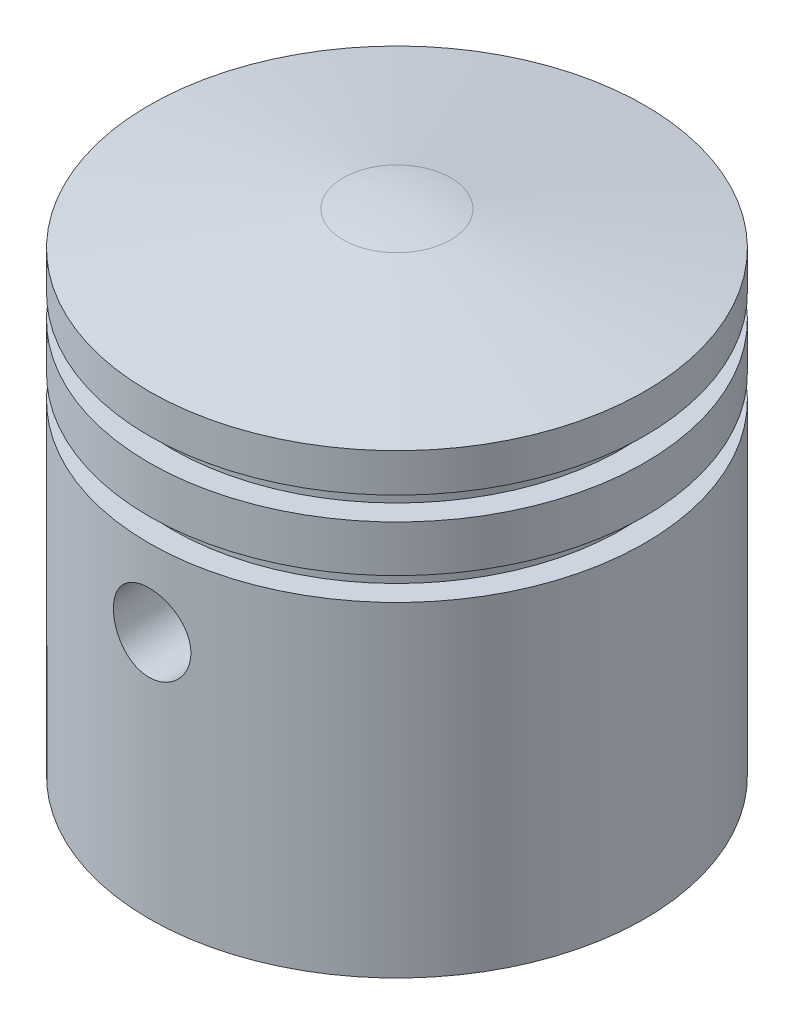
ISO-10303-21;
HEADER;
FILE_DESCRIPTION(('STEP AP214'),'2;1');
FILE_NAME('part.step','',(''),(''),'','','');
FILE_SCHEMA(('AUTOMOTIVE_DESIGN { 1 0 10303 214 1 1 1 1 }'));
ENDSEC;
DATA;
#1=APPLICATION_CONTEXT('core data for automotive mechanical design processes');
#2=APPLICATION_PROTOCOL_DEFINITION('international standard','automotive_design',2000,#1);
#3=PRODUCT_CONTEXT('',#1,'mechanical');
#4=PRODUCT('Part','Part','',(#3));
#5=PRODUCT_RELATED_PRODUCT_CATEGORY('part','',(#4));
#6=PRODUCT_DEFINITION_FORMATION('','',#4);
#7=PRODUCT_DEFINITION_CONTEXT('part definition',#1,'design');
#8=PRODUCT_DEFINITION('design','',#6,#7);
#9=PRODUCT_DEFINITION_SHAPE('','',#8);
#10=(LENGTH_UNIT() NAMED_UNIT(*) SI_UNIT(.MILLI.,.METRE.));
#11=(NAMED_UNIT(*) PLANE_ANGLE_UNIT() SI_UNIT($,.RADIAN.));
#12=(NAMED_UNIT(*) SI_UNIT($,.STERADIAN.) SOLID_ANGLE_UNIT());
#13=UNCERTAINTY_MEASURE_WITH_UNIT(LENGTH_MEASURE(1.E-05),#10,'distance_accuracy_value','');
#14=(GEOMETRIC_REPRESENTATION_CONTEXT(3) GLOBAL_UNCERTAINTY_ASSIGNED_CONTEXT((#13)) GLOBAL_UNIT_ASSIGNED_CONTEXT((#10,
#11,#12)) REPRESENTATION_CONTEXT('',''));
#15=CARTESIAN_POINT('',(0.,0.,0.));
#16=DIRECTION('',(0.,0.,1.));
#17=DIRECTION('',(1.,0.,0.));
#18=AXIS2_PLACEMENT_3D('',#15,#16,#17);
#19=CARTESIAN_POINT('',(0.,8.,0.));
#20=DIRECTION('',(0.,-1.,0.));
#21=DIRECTION('',(0.,0.,-1.));
#22=AXIS2_PLACEMENT_3D('',#19,#20,#21);
#23=CYLINDRICAL_SURFACE('',#22,10.);
#24=CARTESIAN_POINT('',(2.5,0.,-9.68245836551854));
#25=CARTESIAN_POINT('',(2.49999607859307,0.138050750926577,-9.6824610008786));
#26=CARTESIAN_POINT('',(2.48852624549765,0.276144898678522,-9.68544306014597));
#27=CARTESIAN_POINT('',(2.44302312546379,0.54836757817351,-9.69701861992564));
#28=CARTESIAN_POINT('',(2.4089767067421,0.682493754468185,-9.7056153862163));
#29=CARTESIAN_POINT('',(2.31949119963204,0.942803538187182,-9.7273872459615));
#30=CARTESIAN_POINT('',(2.26407972785449,1.06899715538571,-9.74055642690458));
#31=CARTESIAN_POINT('',(2.13352114126138,1.31031085253988,-9.76998192028759));
#32=CARTESIAN_POINT('',(2.05837318856068,1.42543046208022,-9.78623836378489));
#33=CARTESIAN_POINT('',(1.88870842731188,1.64386164526222,-9.82040716355625));
#34=CARTESIAN_POINT('',(1.79383688770405,1.74689360035005,-9.83834597623034));
#35=CARTESIAN_POINT('',(1.58818206410066,1.93576139436034,-9.87362875515294));
#36=CARTESIAN_POINT('',(1.47739729418031,2.02159562562175,-9.89097266566388));
#37=CARTESIAN_POINT('',(1.24114520107895,2.17477546763128,-9.92340415520582));
#38=CARTESIAN_POINT('',(1.11549457619512,2.24184638816147,-9.93845687400592));
#39=CARTESIAN_POINT('',(0.854263184292762,2.35380964415308,-9.96430811925984));
#40=CARTESIAN_POINT('',(0.71868388579194,2.39870525191551,-9.97510727334345));
#41=CARTESIAN_POINT('',(0.444358758754161,2.46414783457858,-9.9910475884818));
#42=CARTESIAN_POINT('',(0.305732719548975,2.48516964432658,-9.99629893844314));
#43=CARTESIAN_POINT('',(0.0268288192627692,2.50375837927555,-10.000935941073));
#44=CARTESIAN_POINT('',(-0.113448794538068,2.5013287722096,-10.000322460967));
#45=CARTESIAN_POINT('',(-0.388380617930968,2.47342514974986,-9.99338094953534));
#46=CARTESIAN_POINT('',(-0.523090539002667,2.44846367494614,-9.98718002340871));
#47=CARTESIAN_POINT('',(-0.786345618534215,2.3770287299515,-9.96990836524857));
#48=CARTESIAN_POINT('',(-0.914890448426095,2.33055411462259,-9.95883737398452));
#49=CARTESIAN_POINT('',(-1.16351675875452,2.21699742931294,-9.93287509700884));
#50=CARTESIAN_POINT('',(-1.28351127441626,2.14973295533825,-9.91795019695011));
#51=CARTESIAN_POINT('',(-1.51068905585122,1.99664432088374,-9.88589903809692));
#52=CARTESIAN_POINT('',(-1.61787008771376,1.91081693143937,-9.8687723965265));
#53=CARTESIAN_POINT('',(-1.81943508771239,1.72029125801763,-9.83363713769356));
#54=CARTESIAN_POINT('',(-1.91339419768799,1.61514510765226,-9.81561719525297));
#55=CARTESIAN_POINT('',(-2.08244093990755,1.39040002645972,-9.78115043517327));
#56=CARTESIAN_POINT('',(-2.15752769011507,1.2708004205089,-9.76470369108289));
#57=CARTESIAN_POINT('',(-2.28697032255647,1.01970996585114,-9.73520496829319));
#58=CARTESIAN_POINT('',(-2.34122391742612,0.888164269687197,-9.72216983717007));
#59=CARTESIAN_POINT('',(-2.42671405159095,0.617414531923158,-9.70118640148669));
#60=CARTESIAN_POINT('',(-2.45795551638266,0.478212136015404,-9.69323700842733));
#61=CARTESIAN_POINT('',(-2.49582963866592,0.200040498470083,-9.68355356007457));
#62=CARTESIAN_POINT('',(-2.50309047391912,0.0611622066589767,-9.68166088976933));
#63=CARTESIAN_POINT('',(-2.49451699051516,-0.215821936585254,-9.68387343364692));
#64=CARTESIAN_POINT('',(-2.4786847978498,-0.353927857949441,-9.687978095703));
#65=CARTESIAN_POINT('',(-2.42492546393825,-0.623114264948572,-9.7015708198498));
#66=CARTESIAN_POINT('',(-2.3873640682819,-0.754272726569197,-9.71096970242532));
#67=CARTESIAN_POINT('',(-2.29161808167046,-1.00843145785333,-9.73400718262805));
#68=CARTESIAN_POINT('',(-2.2334310477125,-1.13143075905578,-9.74764628246408));
#69=CARTESIAN_POINT('',(-2.0967706679366,-1.3684412778669,-9.77796137095511));
#70=CARTESIAN_POINT('',(-2.01792175383564,-1.48222884004298,-9.79469168607245));
#71=CARTESIAN_POINT('',(-1.84265073233613,-1.69518836280148,-9.82917083071113));
#72=CARTESIAN_POINT('',(-1.7462257370136,-1.79435791665011,-9.84691982728307));
#73=CARTESIAN_POINT('',(-1.53565680246182,-1.97781104257092,-9.88197403031774));
#74=CARTESIAN_POINT('',(-1.42112988132898,-2.0616600625488,-9.8992570206188));
#75=CARTESIAN_POINT('',(-1.17925670673669,-2.20893586695125,-9.93097216613689));
#76=CARTESIAN_POINT('',(-1.05191112239398,-2.27236371660821,-9.94540447003949));
#77=CARTESIAN_POINT('',(-0.788895504327728,-2.37644603452793,-9.96970115738325));
#78=CARTESIAN_POINT('',(-0.653293452569707,-2.41726428437906,-9.97959830022409));
#79=CARTESIAN_POINT('',(-0.376874400797019,-2.47546033460841,-9.99385293395789));
#80=CARTESIAN_POINT('',(-0.236058412603102,-2.49284265873904,-9.99821149393422));
#81=CARTESIAN_POINT('',(0.0427088161083075,-2.50341897393885,-10.0008542352202));
#82=CARTESIAN_POINT('',(0.180634567415054,-2.49725427273852,-9.99929947199971));
#83=CARTESIAN_POINT('',(0.453418741036876,-2.46238043176413,-9.99064741143608));
#84=CARTESIAN_POINT('',(0.588277254452321,-2.43367196246708,-9.98355027892922));
#85=CARTESIAN_POINT('',(0.850427589111935,-2.35486945057285,-9.96463582134723));
#86=CARTESIAN_POINT('',(0.977756236452157,-2.30489136671405,-9.95284411255981));
#87=CARTESIAN_POINT('',(1.22229263260406,-2.18507355245107,-9.92578222284145));
#88=CARTESIAN_POINT('',(1.33949910316408,-2.11523131832379,-9.91051160346894));
#89=CARTESIAN_POINT('',(1.56350482105826,-1.95571191500967,-9.87768124200718));
#90=CARTESIAN_POINT('',(1.66998747074584,-1.86559964274043,-9.86007542354161));
#91=CARTESIAN_POINT('',(1.86653755068376,-1.66894287005663,-9.82476622642974));
#92=CARTESIAN_POINT('',(1.95660081269148,-1.56239420972209,-9.80706282418256));
#93=CARTESIAN_POINT('',(2.11940506617958,-1.33349646452635,-9.77318689613756));
#94=CARTESIAN_POINT('',(2.19179154854095,-1.21088969158687,-9.75704909183222));
#95=CARTESIAN_POINT('',(2.31481724146367,-0.954861275312952,-9.7285988873707));
#96=CARTESIAN_POINT('',(2.36547227438038,-0.821447584765384,-9.71628370583034));
#97=CARTESIAN_POINT('',(2.43605632142751,-0.573557470412099,-9.69879771876843));
#98=CARTESIAN_POINT('',(2.4599829264922,-0.460267089034658,-9.69271657508747));
#99=CARTESIAN_POINT('',(2.49195573142942,-0.23132782750578,-9.6845459645655));
#100=CARTESIAN_POINT('',(2.50000328592938,-0.115679149388994,-9.6824561572277));
#101=CARTESIAN_POINT('',(2.5,0.,-9.68245836551854));
#102=B_SPLINE_CURVE_WITH_KNOTS('',3,(#24,#25,#26,#27,#28,#29,#30,#31,#32,#33,#34,#35,#36,#37,
#38,#39,#40,#41,#42,#43,#44,#45,#46,#47,#48,#49,#50,#51,#52,#53,#54,#55,#56,#57,#58,#59,#60,#61,
#62,#63,#64,#65,#66,#67,#68,#69,#70,#71,#72,#73,#74,#75,#76,#77,#78,#79,#80,#81,#82,#83,#84,#85,
#86,#87,#88,#89,#90,#91,#92,#93,#94,#95,#96,#97,#98,#99,#100,#101),.UNSPECIFIED.,.T.,.F.,(4,2,2,
2,2,2,2,2,2,2,2,2,2,2,2,2,2,2,2,2,2,2,2,2,2,2,2,2,2,2,2,2,2,2,2,2,2,2,4),(0.,0.413727441736136,
0.827695741428666,1.24113072716602,1.65458326755479,2.07623954192976,2.49793521479867,
2.9255149639792,3.35303159847092,3.77188750995347,4.1906814866602,4.60018262688947,
5.00970556724786,5.42292874254444,5.83622385468913,6.26070466571911,6.68520531199802,
7.11176432008402,7.53823200129547,7.95343574764204,8.36860127188747,8.77697405014151,
9.18539521426363,9.60182845864102,10.0183301888999,10.4452533097026,10.872154157245,
11.2959207281187,11.7196054891398,12.131834461324,12.5440511738193,12.9540487656466,
13.3640980574302,13.7839709658702,14.2039503157045,14.6317647729113,15.0592672137501,
15.4059782718573,15.7526597510792),.UNSPECIFIED.);
#103=CARTESIAN_POINT('',(2.5,0.,-9.68245836551854));
#104=VERTEX_POINT('',#103);
#105=EDGE_CURVE('E85',#104,#104,#102,.T.);
#106=ORIENTED_EDGE('',*,*,#105,.F.);
#107=EDGE_LOOP('',(#106));
#108=FACE_BOUND('',#107,.T.);
#109=CARTESIAN_POINT('',(0.,8.,0.));
#110=DIRECTION('',(0.,-1.,0.));
#111=DIRECTION('',(0.,0.,-1.));
#112=AXIS2_PLACEMENT_3D('',#109,#110,#111);
#113=CIRCLE('',#112,10.);
#114=CARTESIAN_POINT('',(0.,8.,-10.));
#115=VERTEX_POINT('',#114);
#116=EDGE_CURVE('E100',#115,#115,#113,.T.);
#117=ORIENTED_EDGE('',*,*,#116,.F.);
#118=EDGE_LOOP('',(#117));
#119=FACE_BOUND('',#118,.T.);
#120=CARTESIAN_POINT('',(2.5,0.,9.68245836551854));
#121=CARTESIAN_POINT('',(2.49999607859307,-0.138050750926577,9.6824610008786));
#122=CARTESIAN_POINT('',(2.48852624549765,-0.276144898678522,9.68544306014597));
#123=CARTESIAN_POINT('',(2.44302312546379,-0.54836757817351,9.69701861992564));
#124=CARTESIAN_POINT('',(2.4089767067421,-0.682493754468185,9.7056153862163));
#125=CARTESIAN_POINT('',(2.31949119963204,-0.942803538187182,9.7273872459615));
#126=CARTESIAN_POINT('',(2.26407972785449,-1.06899715538571,9.74055642690458));
#127=CARTESIAN_POINT('',(2.13352114126138,-1.31031085253988,9.76998192028759));
#128=CARTESIAN_POINT('',(2.05837318856068,-1.42543046208022,9.78623836378489));
#129=CARTESIAN_POINT('',(1.88870842731188,-1.64386164526222,9.82040716355625));
#130=CARTESIAN_POINT('',(1.79383688770405,-1.74689360035005,9.83834597623034));
#131=CARTESIAN_POINT('',(1.58818206410066,-1.93576139436034,9.87362875515294));
#132=CARTESIAN_POINT('',(1.47739729418031,-2.02159562562175,9.89097266566388));
#133=CARTESIAN_POINT('',(1.24114520107895,-2.17477546763128,9.92340415520582));
#134=CARTESIAN_POINT('',(1.11549457619512,-2.24184638816147,9.93845687400592));
#135=CARTESIAN_POINT('',(0.854263184292762,-2.35380964415308,9.96430811925984));
#136=CARTESIAN_POINT('',(0.71868388579194,-2.39870525191551,9.97510727334345));
#137=CARTESIAN_POINT('',(0.444358758754161,-2.46414783457858,9.9910475884818));
#138=CARTESIAN_POINT('',(0.305732719548975,-2.48516964432658,9.99629893844314));
#139=CARTESIAN_POINT('',(0.0268288192627692,-2.50375837927555,10.000935941073));
#140=CARTESIAN_POINT('',(-0.113448794538068,-2.5013287722096,10.000322460967));
#141=CARTESIAN_POINT('',(-0.388380617930968,-2.47342514974986,9.99338094953534));
#142=CARTESIAN_POINT('',(-0.523090539002667,-2.44846367494614,9.98718002340871));
#143=CARTESIAN_POINT('',(-0.786345618534215,-2.3770287299515,9.96990836524857));
#144=CARTESIAN_POINT('',(-0.914890448426095,-2.33055411462259,9.95883737398452));
#145=CARTESIAN_POINT('',(-1.16351675875452,-2.21699742931294,9.93287509700884));
#146=CARTESIAN_POINT('',(-1.28351127441626,-2.14973295533825,9.91795019695011));
#147=CARTESIAN_POINT('',(-1.51068905585122,-1.99664432088374,9.88589903809692));
#148=CARTESIAN_POINT('',(-1.61787008771376,-1.91081693143937,9.8687723965265));
#149=CARTESIAN_POINT('',(-1.81943508771239,-1.72029125801763,9.83363713769356));
#150=CARTESIAN_POINT('',(-1.91339419768799,-1.61514510765226,9.81561719525297));
#151=CARTESIAN_POINT('',(-2.08244093990755,-1.39040002645972,9.78115043517327));
#152=CARTESIAN_POINT('',(-2.15752769011507,-1.2708004205089,9.76470369108289));
#153=CARTESIAN_POINT('',(-2.28697032255647,-1.01970996585114,9.73520496829319));
#154=CARTESIAN_POINT('',(-2.34122391742612,-0.888164269687197,9.72216983717007));
#155=CARTESIAN_POINT('',(-2.42671405159095,-0.617414531923158,9.70118640148669));
#156=CARTESIAN_POINT('',(-2.45795551638266,-0.478212136015404,9.69323700842733));
#157=CARTESIAN_POINT('',(-2.49582963866592,-0.200040498470083,9.68355356007457));
#158=CARTESIAN_POINT('',(-2.50309047391912,-0.0611622066589767,9.68166088976933));
#159=CARTESIAN_POINT('',(-2.49451699051516,0.215821936585254,9.68387343364692));
#160=CARTESIAN_POINT('',(-2.4786847978498,0.353927857949441,9.687978095703));
#161=CARTESIAN_POINT('',(-2.42492546393825,0.623114264948572,9.7015708198498));
#162=CARTESIAN_POINT('',(-2.3873640682819,0.754272726569197,9.71096970242532));
#163=CARTESIAN_POINT('',(-2.29161808167046,1.00843145785333,9.73400718262805));
#164=CARTESIAN_POINT('',(-2.2334310477125,1.13143075905578,9.74764628246408));
#165=CARTESIAN_POINT('',(-2.0967706679366,1.3684412778669,9.77796137095511));
#166=CARTESIAN_POINT('',(-2.01792175383564,1.48222884004298,9.79469168607245));
#167=CARTESIAN_POINT('',(-1.84265073233613,1.69518836280148,9.82917083071113));
#168=CARTESIAN_POINT('',(-1.7462257370136,1.79435791665011,9.84691982728307));
#169=CARTESIAN_POINT('',(-1.53565680246182,1.97781104257092,9.88197403031774));
#170=CARTESIAN_POINT('',(-1.42112988132898,2.0616600625488,9.8992570206188));
#171=CARTESIAN_POINT('',(-1.17925670673669,2.20893586695125,9.93097216613689));
#172=CARTESIAN_POINT('',(-1.05191112239398,2.27236371660821,9.94540447003949));
#173=CARTESIAN_POINT('',(-0.788895504327728,2.37644603452793,9.96970115738325));
#174=CARTESIAN_POINT('',(-0.653293452569707,2.41726428437906,9.97959830022409));
#175=CARTESIAN_POINT('',(-0.376874400797019,2.47546033460841,9.99385293395789));
#176=CARTESIAN_POINT('',(-0.236058412603102,2.49284265873904,9.99821149393422));
#177=CARTESIAN_POINT('',(0.0427088161083075,2.50341897393885,10.0008542352202));
#178=CARTESIAN_POINT('',(0.180634567415054,2.49725427273852,9.99929947199971));
#179=CARTESIAN_POINT('',(0.453418741036876,2.46238043176413,9.99064741143608));
#180=CARTESIAN_POINT('',(0.588277254452321,2.43367196246708,9.98355027892922));
#181=CARTESIAN_POINT('',(0.850427589111935,2.35486945057285,9.96463582134723));
#182=CARTESIAN_POINT('',(0.977756236452157,2.30489136671405,9.95284411255981));
#183=CARTESIAN_POINT('',(1.22229263260406,2.18507355245107,9.92578222284145));
#184=CARTESIAN_POINT('',(1.33949910316408,2.11523131832379,9.91051160346894));
#185=CARTESIAN_POINT('',(1.56350482105826,1.95571191500967,9.87768124200718));
#186=CARTESIAN_POINT('',(1.66998747074584,1.86559964274043,9.86007542354161));
#187=CARTESIAN_POINT('',(1.86653755068376,1.66894287005663,9.82476622642974));
#188=CARTESIAN_POINT('',(1.95660081269148,1.56239420972209,9.80706282418256));
#189=CARTESIAN_POINT('',(2.11940506617958,1.33349646452635,9.77318689613756));
#190=CARTESIAN_POINT('',(2.19179154854095,1.21088969158687,9.75704909183222));
#191=CARTESIAN_POINT('',(2.31481724146367,0.954861275312952,9.7285988873707));
#192=CARTESIAN_POINT('',(2.36547227438038,0.821447584765384,9.71628370583034));
#193=CARTESIAN_POINT('',(2.43605632142751,0.573557470412099,9.69879771876843));
#194=CARTESIAN_POINT('',(2.4599829264922,0.460267089034658,9.69271657508747));
#195=CARTESIAN_POINT('',(2.49195573142942,0.23132782750578,9.6845459645655));
#196=CARTESIAN_POINT('',(2.50000328592938,0.115679149388994,9.6824561572277));
#197=CARTESIAN_POINT('',(2.5,0.,9.68245836551854));
#198=B_SPLINE_CURVE_WITH_KNOTS('',3,(#120,#121,#122,#123,#124,#125,#126,#127,#128,#129,#130,
#131,#132,#133,#134,#135,#136,#137,#138,#139,#140,#141,#142,#143,#144,#145,#146,#147,#148,#149,
#150,#151,#152,#153,#154,#155,#156,#157,#158,#159,#160,#161,#162,#163,#164,#165,#166,#167,#168,
#169,#170,#171,#172,#173,#174,#175,#176,#177,#178,#179,#180,#181,#182,#183,#184,#185,#186,#187,
#188,#189,#190,#191,#192,#193,#194,#195,#196,#197),.UNSPECIFIED.,.T.,.F.,(4,2,2,2,2,2,2,2,2,2,2,
2,2,2,2,2,2,2,2,2,2,2,2,2,2,2,2,2,2,2,2,2,2,2,2,2,2,2,4),(0.,0.413727441736136,
0.827695741428666,1.24113072716602,1.65458326755479,2.07623954192976,2.49793521479867,
2.9255149639792,3.35303159847092,3.77188750995347,4.1906814866602,4.60018262688947,
5.00970556724786,5.42292874254444,5.83622385468913,6.26070466571911,6.68520531199802,
7.11176432008402,7.53823200129547,7.95343574764204,8.36860127188747,8.77697405014151,
9.18539521426363,9.60182845864102,10.0183301888999,10.4452533097026,10.872154157245,
11.2959207281187,11.7196054891398,12.131834461324,12.5440511738193,12.9540487656466,
13.3640980574302,13.7839709658702,14.2039503157045,14.6317647729113,15.0592672137501,
15.4059782718573,15.7526597510792),.UNSPECIFIED.);
#199=CARTESIAN_POINT('',(2.5,0.,9.68245836551854));
#200=VERTEX_POINT('',#199);
#201=EDGE_CURVE('E63',#200,#200,#198,.T.);
#202=ORIENTED_EDGE('',*,*,#201,.F.);
#203=EDGE_LOOP('',(#202));
#204=FACE_BOUND('',#203,.T.);
#205=CARTESIAN_POINT('',(0.,-6.,0.));
#206=DIRECTION('',(0.,-1.,0.));
#207=DIRECTION('',(0.,0.,-1.));
#208=AXIS2_PLACEMENT_3D('',#205,#206,#207);
#209=CIRCLE('',#208,10.);
#210=CARTESIAN_POINT('',(0.,-6.,-10.));
#211=VERTEX_POINT('',#210);
#212=EDGE_CURVE('E40',#211,#211,#209,.F.);
#213=ORIENTED_EDGE('',*,*,#212,.F.);
#214=EDGE_LOOP('',(#213));
#215=FACE_BOUND('',#214,.T.);
#216=ADVANCED_FACE('F36',(#108,#119,#204,#215),#23,.F.);
#217=CARTESIAN_POINT('',(0.,0.,-16.));
#218=DIRECTION('',(0.,0.,1.));
#219=DIRECTION('',(1.,0.,0.));
#220=AXIS2_PLACEMENT_3D('',#217,#218,#219);
#221=CYLINDRICAL_SURFACE('',#220,2.5);
#222=ORIENTED_EDGE('',*,*,#105,.T.);
#223=EDGE_LOOP('',(#222));
#224=FACE_BOUND('',#223,.T.);
#225=CARTESIAN_POINT('',(0.,2.5,-16.));
#226=CARTESIAN_POINT('',(-0.139515097271033,2.49999430172848,-15.9999977019448));
#227=CARTESIAN_POINT('',(-0.279109404865704,2.48828188622644,-15.9981561248574));
#228=CARTESIAN_POINT('',(-0.554391314978102,2.44175630872324,-15.9909869809759));
#229=CARTESIAN_POINT('',(-0.690075061323317,2.40692110749649,-15.9856560884472));
#230=CARTESIAN_POINT('',(-0.953512538047404,2.31522033719338,-15.9721069716578));
#231=CARTESIAN_POINT('',(-1.0812723522899,2.2583719186384,-15.9638909956317));
#232=CARTESIAN_POINT('',(-1.3254212510446,2.12430145485839,-15.9454779403815));
#233=CARTESIAN_POINT('',(-1.44181181036831,2.04708205696406,-15.9352811186255));
#234=CARTESIAN_POINT('',(-1.66091991165162,1.87376695164604,-15.9139426841436));
#235=CARTESIAN_POINT('',(-1.76352747914264,1.77753300510975,-15.9027945139234));
#236=CARTESIAN_POINT('',(-1.95120768822823,1.56921805173111,-15.8808607613029));
#237=CARTESIAN_POINT('',(-2.03627928654192,1.4571361026998,-15.8700752005075));
#238=CARTESIAN_POINT('',(-2.18690544328884,1.21956172865627,-15.8500242812745));
#239=CARTESIAN_POINT('',(-2.25235273557991,1.09400051763821,-15.840767397861));
#240=CARTESIAN_POINT('',(-2.36118681597065,0.833498589142195,-15.8249120174236));
#241=CARTESIAN_POINT('',(-2.40457491010063,0.69855842748944,-15.8183133630222));
#242=CARTESIAN_POINT('',(-2.46771559322167,0.424289098856214,-15.8085863451104));
#243=CARTESIAN_POINT('',(-2.48765705487496,0.285004414181201,-15.8054302653236));
#244=CARTESIAN_POINT('',(-2.50392369757621,0.00503281110735587,-15.8028617107177));
#245=CARTESIAN_POINT('',(-2.50025034860466,-0.13565401946604,-15.8034490028802));
#246=CARTESIAN_POINT('',(-2.4695458080889,-0.413097031852685,-15.8082755045521));
#247=CARTESIAN_POINT('',(-2.44272562959693,-0.549877223353148,-15.8124817218495));
#248=CARTESIAN_POINT('',(-2.36681937833751,-0.816972006359324,-15.8240205634547));
#249=CARTESIAN_POINT('',(-2.31773262684132,-0.947286400640537,-15.8313532830641));
#250=CARTESIAN_POINT('',(-2.19846916949384,-1.19838871267716,-15.8483550685462));
#251=CARTESIAN_POINT('',(-2.12820372315549,-1.31913379177307,-15.8580339308724));
#252=CARTESIAN_POINT('',(-1.96864058146637,-1.54719953568554,-15.878630461501));
#253=CARTESIAN_POINT('',(-1.87934153253017,-1.65451924488747,-15.8895482178821));
#254=CARTESIAN_POINT('',(-1.68309088822333,-1.85391024663331,-15.911537862489));
#255=CARTESIAN_POINT('',(-1.57595800560539,-1.94580315826946,-15.9226101363559));
#256=CARTESIAN_POINT('',(-1.34769694737936,-2.1103331456399,-15.9435512534783));
#257=CARTESIAN_POINT('',(-1.22656870068132,-2.18297012355683,-15.9534200906202));
#258=CARTESIAN_POINT('',(-0.973595927056491,-2.30693807342239,-15.9708539902704));
#259=CARTESIAN_POINT('',(-0.84174418624046,-2.358254558533,-15.9784174854193));
#260=CARTESIAN_POINT('',(-0.571149534696759,-2.43796596744723,-15.9903756000068));
#261=CARTESIAN_POINT('',(-0.4324071306872,-2.46636257406648,-15.9947704520898));
#262=CARTESIAN_POINT('',(-0.153508336763734,-2.49918927645019,-15.9998651172728));
#263=CARTESIAN_POINT('',(-0.0133814615087012,-2.50386447897618,-16.0006027179286));
#264=CARTESIAN_POINT('',(0.265654546411643,-2.48976729466402,-15.9984028649127));
#265=CARTESIAN_POINT('',(0.404563719925157,-2.47099569741089,-15.9954655349964));
#266=CARTESIAN_POINT('',(0.676473446265705,-2.41074161231982,-15.9862692369322));
#267=CARTESIAN_POINT('',(0.809501262056042,-2.36937924173227,-15.9800278421539));
#268=CARTESIAN_POINT('',(1.06673406785663,-2.26524490560121,-15.9649207568356));
#269=CARTESIAN_POINT('',(1.19093861303941,-2.20247186155733,-15.9560549341007));
#270=CARTESIAN_POINT('',(1.42807220225041,-2.05672800887342,-15.9365897274094));
#271=CARTESIAN_POINT('',(1.54090512378373,-1.97360257990952,-15.9259772866342));
#272=CARTESIAN_POINT('',(1.75110696507806,-1.78972791409221,-15.9042388046444));
#273=CARTESIAN_POINT('',(1.84847490447018,-1.68897756079515,-15.8931127309268));
#274=CARTESIAN_POINT('',(2.02588080776691,-1.47161880278279,-15.8714802753665));
#275=CARTESIAN_POINT('',(2.10575398584126,-1.35487515287767,-15.860980411908));
#276=CARTESIAN_POINT('',(2.2447556772664,-1.10948392633866,-15.8419069280583));
#277=CARTESIAN_POINT('',(2.30388478778105,-0.980836692510523,-15.83333325222));
#278=CARTESIAN_POINT('',(2.39946771944995,-0.715770359285808,-15.8191307135236));
#279=CARTESIAN_POINT('',(2.43600654947912,-0.579382531234375,-15.8134908234896));
#280=CARTESIAN_POINT('',(2.48564122040535,-0.302310856336017,-15.8057657028079));
#281=CARTESIAN_POINT('',(2.49873883084997,-0.161627334580991,-15.8036802038444));
#282=CARTESIAN_POINT('',(2.50107452690756,0.118398715907477,-15.8033105804488));
#283=CARTESIAN_POINT('',(2.49057180548425,0.257739096933504,-15.804985160429));
#284=CARTESIAN_POINT('',(2.44656223255901,0.532645297144287,-15.8118569894183));
#285=CARTESIAN_POINT('',(2.41305543086961,0.668211124501717,-15.8170542307995));
#286=CARTESIAN_POINT('',(2.32408329891851,0.93163782664052,-15.8303708885491));
#287=CARTESIAN_POINT('',(2.26863761738581,1.05950547825841,-15.8384876895341));
#288=CARTESIAN_POINT('',(2.13738768546417,1.30416561367627,-15.856731840474));
#289=CARTESIAN_POINT('',(2.06158262820886,1.42095765828843,-15.8668592701083));
#290=CARTESIAN_POINT('',(1.89083008139079,1.64146554412683,-15.8881156809226));
#291=CARTESIAN_POINT('',(1.79569107094768,1.74503219661384,-15.8992540116029));
#292=CARTESIAN_POINT('',(1.58937594638204,1.93482123638674,-15.9212004364073));
#293=CARTESIAN_POINT('',(1.47819612078432,2.02103959859188,-15.9320084534012));
#294=CARTESIAN_POINT('',(1.24216685884341,2.17415122303156,-15.952151024567));
#295=CARTESIAN_POINT('',(1.11723937214238,2.24092537275962,-15.9614763443027));
#296=CARTESIAN_POINT('',(0.857851882357781,2.35244099619295,-15.9775125983888));
#297=CARTESIAN_POINT('',(0.723401776581759,2.39720497255839,-15.9842262014212));
#298=CARTESIAN_POINT('',(0.490314239911591,2.45343302109059,-15.9927744586488));
#299=CARTESIAN_POINT('',(0.393105575651622,2.470868490629,-15.9954699162612));
#300=CARTESIAN_POINT('',(0.197277797850581,2.49415391337908,-15.9990834869762));
#301=CARTESIAN_POINT('',(0.0986587041691179,2.50000402955734,-16.0000016250796));
#302=CARTESIAN_POINT('',(0.,2.5,-16.));
#303=B_SPLINE_CURVE_WITH_KNOTS('',3,(#225,#226,#227,#228,#229,#230,#231,#232,#233,#234,#235,
#236,#237,#238,#239,#240,#241,#242,#243,#244,#245,#246,#247,#248,#249,#250,#251,#252,#253,#254,
#255,#256,#257,#258,#259,#260,#261,#262,#263,#264,#265,#266,#267,#268,#269,#270,#271,#272,#273,
#274,#275,#276,#277,#278,#279,#280,#281,#282,#283,#284,#285,#286,#287,#288,#289,#290,#291,#292,
#293,#294,#295,#296,#297,#298,#299,#300,#301,#302),.UNSPECIFIED.,.T.,.F.,(4,2,2,2,2,2,2,2,2,2,2,
2,2,2,2,2,2,2,2,2,2,2,2,2,2,2,2,2,2,2,2,2,2,2,2,2,2,2,4),(0.,0.418184740477491,
0.836768642528014,1.25502707944103,1.6732311879203,2.09459568152199,2.51598523645422,
2.93963778605759,3.36326525009238,3.78345631134994,4.20362121670545,4.6199957602258,
5.0363829965105,5.45453977402347,5.87272629892068,6.29545732334367,6.71819049513827,
7.14121043754564,7.56419931829866,7.98280854005914,8.40140366528356,8.81779444756567,
9.23420620742031,9.65388541469671,10.0735912160142,10.4970948024959,10.9205861964898,
11.3424741039513,11.764330162293,12.1815758159869,12.598820566189,13.0156924696662,
13.4325808967135,13.8538201231554,14.275156971423,14.6990230419984,15.1224548565628,
15.4181801635154,15.7139013105871),.UNSPECIFIED.);
#304=CARTESIAN_POINT('',(0.,2.5,-16.));
#305=VERTEX_POINT('',#304);
#306=EDGE_CURVE('E10',#305,#305,#303,.T.);
#307=ORIENTED_EDGE('',*,*,#306,.F.);
#308=EDGE_LOOP('',(#307));
#309=FACE_BOUND('',#308,.T.);
#310=ADVANCED_FACE('F79',(#224,#309),#221,.F.);
#311=CARTESIAN_POINT('',(0.,13.4873005463795,0.));
#312=DIRECTION('',(0.,-1.,0.));
#313=DIRECTION('',(0.,0.,-1.));
#314=AXIS2_PLACEMENT_3D('',#311,#312,#313);
#315=CONICAL_SURFACE('',#314,16.,1.39626340159546);
#316=CARTESIAN_POINT('',(0.,15.6961550602442,0.));
#317=DIRECTION('',(0.,1.,0.));
#318=DIRECTION('',(0.,0.,1.));
#319=AXIS2_PLACEMENT_3D('',#316,#317,#318);
#320=CIRCLE('',#319,3.47296355333861);
#321=CARTESIAN_POINT('',(0.,15.6961550602442,3.47296355333861));
#322=VERTEX_POINT('',#321);
#323=EDGE_CURVE('E91',#322,#322,#320,.T.);
#324=ORIENTED_EDGE('',*,*,#323,.F.);
#325=EDGE_LOOP('',(#324));
#326=FACE_BOUND('',#325,.T.);
#327=CARTESIAN_POINT('',(0.,13.4873005463795,0.));
#328=DIRECTION('',(0.,1.,0.));
#329=DIRECTION('',(0.,0.,1.));
#330=AXIS2_PLACEMENT_3D('',#327,#328,#329);
#331=CIRCLE('',#330,16.);
#332=CARTESIAN_POINT('',(0.,13.4873005463795,16.));
#333=VERTEX_POINT('',#332);
#334=EDGE_CURVE('E51',#333,#333,#331,.T.);
#335=ORIENTED_EDGE('',*,*,#334,.T.);
#336=EDGE_LOOP('',(#335));
#337=FACE_BOUND('',#336,.T.);
#338=ADVANCED_FACE('F38',(#326,#337),#315,.T.);
#339=CARTESIAN_POINT('',(0.,16.,0.));
#340=DIRECTION('',(0.,1.,0.));
#341=DIRECTION('',(0.,0.,1.));
#342=AXIS2_PLACEMENT_3D('',#339,#340,#341);
#343=CYLINDRICAL_SURFACE('',#342,16.);
#344=ORIENTED_EDGE('',*,*,#334,.F.);
#345=EDGE_LOOP('',(#344));
#346=FACE_BOUND('',#345,.T.);
#347=CARTESIAN_POINT('',(0.,11.,0.));
#348=DIRECTION('',(0.,1.,0.));
#349=DIRECTION('',(0.,0.,1.));
#350=AXIS2_PLACEMENT_3D('',#347,#348,#349);
#351=CIRCLE('',#350,16.);
#352=CARTESIAN_POINT('',(0.,11.,16.));
#353=VERTEX_POINT('',#352);
#354=EDGE_CURVE('E145',#353,#353,#351,.T.);
#355=ORIENTED_EDGE('',*,*,#354,.T.);
#356=EDGE_LOOP('',(#355));
#357=FACE_BOUND('',#356,.T.);
#358=ADVANCED_FACE('F153',(#346,#357),#343,.T.);
#359=CARTESIAN_POINT('',(16.,11.,0.));
#360=DIRECTION('',(0.,1.,0.));
#361=DIRECTION('',(0.,0.,1.));
#362=AXIS2_PLACEMENT_3D('',#359,#360,#361);
#363=PLANE('',#362);
#364=ORIENTED_EDGE('',*,*,#354,.F.);
#365=EDGE_LOOP('',(#364));
#366=FACE_BOUND('',#365,.T.);
#367=CARTESIAN_POINT('',(0.,11.,0.));
#368=DIRECTION('',(0.,1.,0.));
#369=DIRECTION('',(0.,0.,1.));
#370=AXIS2_PLACEMENT_3D('',#367,#368,#369);
#371=CIRCLE('',#370,14.5);
#372=CARTESIAN_POINT('',(0.,11.,14.5));
#373=VERTEX_POINT('',#372);
#374=EDGE_CURVE('E141',#373,#373,#371,.T.);
#375=ORIENTED_EDGE('',*,*,#374,.T.);
#376=EDGE_LOOP('',(#375));
#377=FACE_BOUND('',#376,.T.);
#378=ADVANCED_FACE('F156',(#366,#377),#363,.F.);
#379=CARTESIAN_POINT('',(0.,16.,0.));
#380=DIRECTION('',(0.,1.,0.));
#381=DIRECTION('',(0.,0.,1.));
#382=AXIS2_PLACEMENT_3D('',#379,#380,#381);
#383=CYLINDRICAL_SURFACE('',#382,14.5);
#384=ORIENTED_EDGE('',*,*,#374,.F.);
#385=EDGE_LOOP('',(#384));
#386=FACE_BOUND('',#385,.T.);
#387=CARTESIAN_POINT('',(0.,9.5,0.));
#388=DIRECTION('',(0.,1.,0.));
#389=DIRECTION('',(0.,0.,1.));
#390=AXIS2_PLACEMENT_3D('',#387,#388,#389);
#391=CIRCLE('',#390,14.5);
#392=CARTESIAN_POINT('',(0.,9.5,14.5));
#393=VERTEX_POINT('',#392);
#394=EDGE_CURVE('E137',#393,#393,#391,.T.);
#395=ORIENTED_EDGE('',*,*,#394,.T.);
#396=EDGE_LOOP('',(#395));
#397=FACE_BOUND('',#396,.T.);
#398=ADVANCED_FACE('F161',(#386,#397),#383,.T.);
#399=CARTESIAN_POINT('',(14.5,9.5,0.));
#400=DIRECTION('',(0.,-1.,0.));
#401=DIRECTION('',(0.,0.,-1.));
#402=AXIS2_PLACEMENT_3D('',#399,#400,#401);
#403=PLANE('',#402);
#404=ORIENTED_EDGE('',*,*,#394,.F.);
#405=EDGE_LOOP('',(#404));
#406=FACE_BOUND('',#405,.T.);
#407=CARTESIAN_POINT('',(0.,9.5,0.));
#408=DIRECTION('',(0.,1.,0.));
#409=DIRECTION('',(0.,0.,1.));
#410=AXIS2_PLACEMENT_3D('',#407,#408,#409);
#411=CIRCLE('',#410,16.);
#412=CARTESIAN_POINT('',(0.,9.5,16.));
#413=VERTEX_POINT('',#412);
#414=EDGE_CURVE('E133',#413,#413,#411,.T.);
#415=ORIENTED_EDGE('',*,*,#414,.T.);
#416=EDGE_LOOP('',(#415));
#417=FACE_BOUND('',#416,.T.);
#418=ADVANCED_FACE('F167',(#406,#417),#403,.F.);
#419=CARTESIAN_POINT('',(0.,16.,0.));
#420=DIRECTION('',(0.,1.,0.));
#421=DIRECTION('',(0.,0.,1.));
#422=AXIS2_PLACEMENT_3D('',#419,#420,#421);
#423=CYLINDRICAL_SURFACE('',#422,16.);
#424=ORIENTED_EDGE('',*,*,#414,.F.);
#425=EDGE_LOOP('',(#424));
#426=FACE_BOUND('',#425,.T.);
#427=CARTESIAN_POINT('',(0.,6.5,0.));
#428=DIRECTION('',(0.,1.,0.));
#429=DIRECTION('',(0.,0.,1.));
#430=AXIS2_PLACEMENT_3D('',#427,#428,#429);
#431=CIRCLE('',#430,16.);
#432=CARTESIAN_POINT('',(0.,6.5,16.));
#433=VERTEX_POINT('',#432);
#434=EDGE_CURVE('E129',#433,#433,#431,.T.);
#435=ORIENTED_EDGE('',*,*,#434,.T.);
#436=EDGE_LOOP('',(#435));
#437=FACE_BOUND('',#436,.T.);
#438=ADVANCED_FACE('F173',(#426,#437),#423,.T.);
#439=CARTESIAN_POINT('',(16.,6.5,0.));
#440=DIRECTION('',(0.,1.,0.));
#441=DIRECTION('',(0.,0.,1.));
#442=AXIS2_PLACEMENT_3D('',#439,#440,#441);
#443=PLANE('',#442);
#444=ORIENTED_EDGE('',*,*,#434,.F.);
#445=EDGE_LOOP('',(#444));
#446=FACE_BOUND('',#445,.T.);
#447=CARTESIAN_POINT('',(0.,6.5,0.));
#448=DIRECTION('',(0.,1.,0.));
#449=DIRECTION('',(0.,0.,1.));
#450=AXIS2_PLACEMENT_3D('',#447,#448,#449);
#451=CIRCLE('',#450,14.5);
#452=CARTESIAN_POINT('',(0.,6.5,14.5));
#453=VERTEX_POINT('',#452);
#454=EDGE_CURVE('E125',#453,#453,#451,.T.);
#455=ORIENTED_EDGE('',*,*,#454,.T.);
#456=EDGE_LOOP('',(#455));
#457=FACE_BOUND('',#456,.T.);
#458=ADVANCED_FACE('F179',(#446,#457),#443,.F.);
#459=CARTESIAN_POINT('',(0.,16.,0.));
#460=DIRECTION('',(0.,1.,0.));
#461=DIRECTION('',(0.,0.,1.));
#462=AXIS2_PLACEMENT_3D('',#459,#460,#461);
#463=CYLINDRICAL_SURFACE('',#462,14.5);
#464=ORIENTED_EDGE('',*,*,#454,.F.);
#465=EDGE_LOOP('',(#464));
#466=FACE_BOUND('',#465,.T.);
#467=CARTESIAN_POINT('',(0.,5.,0.));
#468=DIRECTION('',(0.,1.,0.));
#469=DIRECTION('',(0.,0.,1.));
#470=AXIS2_PLACEMENT_3D('',#467,#468,#469);
#471=CIRCLE('',#470,14.5);
#472=CARTESIAN_POINT('',(0.,5.,14.5));
#473=VERTEX_POINT('',#472);
#474=EDGE_CURVE('E121',#473,#473,#471,.T.);
#475=ORIENTED_EDGE('',*,*,#474,.T.);
#476=EDGE_LOOP('',(#475));
#477=FACE_BOUND('',#476,.T.);
#478=ADVANCED_FACE('F185',(#466,#477),#463,.T.);
#479=CARTESIAN_POINT('',(14.5,5.,0.));
#480=DIRECTION('',(0.,-1.,0.));
#481=DIRECTION('',(0.,0.,-1.));
#482=AXIS2_PLACEMENT_3D('',#479,#480,#481);
#483=PLANE('',#482);
#484=ORIENTED_EDGE('',*,*,#474,.F.);
#485=EDGE_LOOP('',(#484));
#486=FACE_BOUND('',#485,.T.);
#487=CARTESIAN_POINT('',(0.,5.,0.));
#488=DIRECTION('',(0.,1.,0.));
#489=DIRECTION('',(0.,0.,1.));
#490=AXIS2_PLACEMENT_3D('',#487,#488,#489);
#491=CIRCLE('',#490,16.);
#492=CARTESIAN_POINT('',(0.,5.,16.));
#493=VERTEX_POINT('',#492);
#494=EDGE_CURVE('E117',#493,#493,#491,.T.);
#495=ORIENTED_EDGE('',*,*,#494,.T.);
#496=EDGE_LOOP('',(#495));
#497=FACE_BOUND('',#496,.T.);
#498=ADVANCED_FACE('F191',(#486,#497),#483,.F.);
#499=CARTESIAN_POINT('',(0.,16.,0.));
#500=DIRECTION('',(0.,1.,0.));
#501=DIRECTION('',(0.,0.,1.));
#502=AXIS2_PLACEMENT_3D('',#499,#500,#501);
#503=CYLINDRICAL_SURFACE('',#502,16.);
#504=ORIENTED_EDGE('',*,*,#306,.T.);
#505=EDGE_LOOP('',(#504));
#506=FACE_BOUND('',#505,.T.);
#507=CARTESIAN_POINT('',(0.,-2.5,16.));
#508=CARTESIAN_POINT('',(-0.139515097271033,-2.49999430172848,15.9999977019448));
#509=CARTESIAN_POINT('',(-0.279109404865704,-2.48828188622644,15.9981561248574));
#510=CARTESIAN_POINT('',(-0.554391314978102,-2.44175630872324,15.9909869809759));
#511=CARTESIAN_POINT('',(-0.690075061323317,-2.40692110749649,15.9856560884472));
#512=CARTESIAN_POINT('',(-0.953512538047404,-2.31522033719338,15.9721069716578));
#513=CARTESIAN_POINT('',(-1.0812723522899,-2.2583719186384,15.9638909956317));
#514=CARTESIAN_POINT('',(-1.3254212510446,-2.12430145485839,15.9454779403815));
#515=CARTESIAN_POINT('',(-1.44181181036831,-2.04708205696406,15.9352811186255));
#516=CARTESIAN_POINT('',(-1.66091991165162,-1.87376695164604,15.9139426841436));
#517=CARTESIAN_POINT('',(-1.76352747914264,-1.77753300510975,15.9027945139234));
#518=CARTESIAN_POINT('',(-1.95120768822823,-1.56921805173111,15.8808607613029));
#519=CARTESIAN_POINT('',(-2.03627928654192,-1.4571361026998,15.8700752005075));
#520=CARTESIAN_POINT('',(-2.18690544328884,-1.21956172865627,15.8500242812745));
#521=CARTESIAN_POINT('',(-2.25235273557991,-1.09400051763821,15.840767397861));
#522=CARTESIAN_POINT('',(-2.36118681597065,-0.833498589142195,15.8249120174236));
#523=CARTESIAN_POINT('',(-2.40457491010063,-0.69855842748944,15.8183133630222));
#524=CARTESIAN_POINT('',(-2.46771559322167,-0.424289098856214,15.8085863451104));
#525=CARTESIAN_POINT('',(-2.48765705487496,-0.285004414181201,15.8054302653236));
#526=CARTESIAN_POINT('',(-2.50392369757621,-0.00503281110735587,15.8028617107177));
#527=CARTESIAN_POINT('',(-2.50025034860466,0.13565401946604,15.8034490028802));
#528=CARTESIAN_POINT('',(-2.4695458080889,0.413097031852685,15.8082755045521));
#529=CARTESIAN_POINT('',(-2.44272562959693,0.549877223353148,15.8124817218495));
#530=CARTESIAN_POINT('',(-2.36681937833751,0.816972006359324,15.8240205634547));
#531=CARTESIAN_POINT('',(-2.31773262684132,0.947286400640537,15.8313532830641));
#532=CARTESIAN_POINT('',(-2.19846916949384,1.19838871267716,15.8483550685462));
#533=CARTESIAN_POINT('',(-2.12820372315549,1.31913379177307,15.8580339308724));
#534=CARTESIAN_POINT('',(-1.96864058146637,1.54719953568554,15.878630461501));
#535=CARTESIAN_POINT('',(-1.87934153253017,1.65451924488747,15.8895482178821));
#536=CARTESIAN_POINT('',(-1.68309088822333,1.85391024663331,15.911537862489));
#537=CARTESIAN_POINT('',(-1.57595800560539,1.94580315826946,15.9226101363559));
#538=CARTESIAN_POINT('',(-1.34769694737936,2.1103331456399,15.9435512534783));
#539=CARTESIAN_POINT('',(-1.22656870068132,2.18297012355683,15.9534200906202));
#540=CARTESIAN_POINT('',(-0.973595927056491,2.30693807342239,15.9708539902704));
#541=CARTESIAN_POINT('',(-0.84174418624046,2.358254558533,15.9784174854193));
#542=CARTESIAN_POINT('',(-0.571149534696759,2.43796596744723,15.9903756000068));
#543=CARTESIAN_POINT('',(-0.4324071306872,2.46636257406648,15.9947704520898));
#544=CARTESIAN_POINT('',(-0.153508336763734,2.49918927645019,15.9998651172728));
#545=CARTESIAN_POINT('',(-0.0133814615087012,2.50386447897618,16.0006027179286));
#546=CARTESIAN_POINT('',(0.265654546411643,2.48976729466402,15.9984028649127));
#547=CARTESIAN_POINT('',(0.404563719925157,2.47099569741089,15.9954655349964));
#548=CARTESIAN_POINT('',(0.676473446265705,2.41074161231982,15.9862692369322));
#549=CARTESIAN_POINT('',(0.809501262056042,2.36937924173227,15.9800278421539));
#550=CARTESIAN_POINT('',(1.06673406785663,2.26524490560121,15.9649207568356));
#551=CARTESIAN_POINT('',(1.19093861303941,2.20247186155733,15.9560549341007));
#552=CARTESIAN_POINT('',(1.42807220225041,2.05672800887342,15.9365897274094));
#553=CARTESIAN_POINT('',(1.54090512378373,1.97360257990952,15.9259772866342));
#554=CARTESIAN_POINT('',(1.75110696507806,1.78972791409221,15.9042388046444));
#555=CARTESIAN_POINT('',(1.84847490447018,1.68897756079515,15.8931127309268));
#556=CARTESIAN_POINT('',(2.02588080776691,1.47161880278279,15.8714802753665));
#557=CARTESIAN_POINT('',(2.10575398584126,1.35487515287767,15.860980411908));
#558=CARTESIAN_POINT('',(2.2447556772664,1.10948392633866,15.8419069280583));
#559=CARTESIAN_POINT('',(2.30388478778105,0.980836692510523,15.83333325222));
#560=CARTESIAN_POINT('',(2.39946771944995,0.715770359285808,15.8191307135236));
#561=CARTESIAN_POINT('',(2.43600654947912,0.579382531234375,15.8134908234896));
#562=CARTESIAN_POINT('',(2.48564122040535,0.302310856336017,15.8057657028079));
#563=CARTESIAN_POINT('',(2.49873883084997,0.161627334580991,15.8036802038444));
#564=CARTESIAN_POINT('',(2.50107452690756,-0.118398715907477,15.8033105804488));
#565=CARTESIAN_POINT('',(2.49057180548425,-0.257739096933504,15.804985160429));
#566=CARTESIAN_POINT('',(2.44656223255901,-0.532645297144287,15.8118569894183));
#567=CARTESIAN_POINT('',(2.41305543086961,-0.668211124501717,15.8170542307995));
#568=CARTESIAN_POINT('',(2.32408329891851,-0.93163782664052,15.8303708885491));
#569=CARTESIAN_POINT('',(2.26863761738581,-1.05950547825841,15.8384876895341));
#570=CARTESIAN_POINT('',(2.13738768546417,-1.30416561367627,15.856731840474));
#571=CARTESIAN_POINT('',(2.06158262820886,-1.42095765828843,15.8668592701083));
#572=CARTESIAN_POINT('',(1.89083008139079,-1.64146554412683,15.8881156809226));
#573=CARTESIAN_POINT('',(1.79569107094768,-1.74503219661384,15.8992540116029));
#574=CARTESIAN_POINT('',(1.58937594638204,-1.93482123638674,15.9212004364073));
#575=CARTESIAN_POINT('',(1.47819612078432,-2.02103959859188,15.9320084534012));
#576=CARTESIAN_POINT('',(1.24216685884341,-2.17415122303156,15.952151024567));
#577=CARTESIAN_POINT('',(1.11723937214238,-2.24092537275962,15.9614763443027));
#578=CARTESIAN_POINT('',(0.857851882357781,-2.35244099619295,15.9775125983888));
#579=CARTESIAN_POINT('',(0.723401776581759,-2.39720497255839,15.9842262014212));
#580=CARTESIAN_POINT('',(0.490314239911591,-2.45343302109059,15.9927744586488));
#581=CARTESIAN_POINT('',(0.393105575651622,-2.470868490629,15.9954699162612));
#582=CARTESIAN_POINT('',(0.197277797850581,-2.49415391337908,15.9990834869762));
#583=CARTESIAN_POINT('',(0.0986587041691179,-2.50000402955734,16.0000016250796));
#584=CARTESIAN_POINT('',(0.,-2.5,16.));
#585=B_SPLINE_CURVE_WITH_KNOTS('',3,(#507,#508,#509,#510,#511,#512,#513,#514,#515,#516,#517,
#518,#519,#520,#521,#522,#523,#524,#525,#526,#527,#528,#529,#530,#531,#532,#533,#534,#535,#536,
#537,#538,#539,#540,#541,#542,#543,#544,#545,#546,#547,#548,#549,#550,#551,#552,#553,#554,#555,
#556,#557,#558,#559,#560,#561,#562,#563,#564,#565,#566,#567,#568,#569,#570,#571,#572,#573,#574,
#575,#576,#577,#578,#579,#580,#581,#582,#583,#584),.UNSPECIFIED.,.T.,.F.,(4,2,2,2,2,2,2,2,2,2,2,
2,2,2,2,2,2,2,2,2,2,2,2,2,2,2,2,2,2,2,2,2,2,2,2,2,2,2,4),(0.,0.418184740477491,
0.836768642528014,1.25502707944103,1.6732311879203,2.09459568152199,2.51598523645422,
2.93963778605759,3.36326525009238,3.78345631134994,4.20362121670545,4.6199957602258,
5.0363829965105,5.45453977402347,5.87272629892068,6.29545732334367,6.71819049513827,
7.14121043754564,7.56419931829866,7.98280854005914,8.40140366528356,8.81779444756567,
9.23420620742031,9.65388541469671,10.0735912160142,10.4970948024959,10.9205861964898,
11.3424741039513,11.764330162293,12.1815758159869,12.598820566189,13.0156924696662,
13.4325808967135,13.8538201231554,14.275156971423,14.6990230419984,15.1224548565628,
15.4181801635154,15.7139013105871),.UNSPECIFIED.);
#586=CARTESIAN_POINT('',(0.,-2.5,16.));
#587=VERTEX_POINT('',#586);
#588=EDGE_CURVE('E45',#587,#587,#585,.T.);
#589=ORIENTED_EDGE('',*,*,#588,.T.);
#590=EDGE_LOOP('',(#589));
#591=FACE_BOUND('',#590,.T.);
#592=ORIENTED_EDGE('',*,*,#494,.F.);
#593=EDGE_LOOP('',(#592));
#594=FACE_BOUND('',#593,.T.);
#595=CARTESIAN_POINT('',(0.,-16.,0.));
#596=DIRECTION('',(0.,1.,0.));
#597=DIRECTION('',(0.,0.,1.));
#598=AXIS2_PLACEMENT_3D('',#595,#596,#597);
#599=CIRCLE('',#598,16.);
#600=CARTESIAN_POINT('',(0.,-16.,16.));
#601=VERTEX_POINT('',#600);
#602=EDGE_CURVE('E97',#601,#601,#599,.T.);
#603=ORIENTED_EDGE('',*,*,#602,.T.);
#604=EDGE_LOOP('',(#603));
#605=FACE_BOUND('',#604,.T.);
#606=ADVANCED_FACE('F68',(#506,#591,#594,#605),#503,.T.);
#607=CARTESIAN_POINT('',(16.,-16.,0.));
#608=DIRECTION('',(0.,1.,0.));
#609=DIRECTION('',(0.,0.,1.));
#610=AXIS2_PLACEMENT_3D('',#607,#608,#609);
#611=PLANE('',#610);
#612=CARTESIAN_POINT('',(0.,-16.,0.));
#613=DIRECTION('',(0.,-1.,0.));
#614=DIRECTION('',(0.,0.,-1.));
#615=AXIS2_PLACEMENT_3D('',#612,#613,#614);
#616=CIRCLE('',#615,13.);
#617=CARTESIAN_POINT('',(0.,-16.,-13.));
#618=VERTEX_POINT('',#617);
#619=EDGE_CURVE('E111',#618,#618,#616,.T.);
#620=ORIENTED_EDGE('',*,*,#619,.F.);
#621=EDGE_LOOP('',(#620));
#622=FACE_BOUND('',#621,.T.);
#623=ORIENTED_EDGE('',*,*,#602,.F.);
#624=EDGE_LOOP('',(#623));
#625=FACE_BOUND('',#624,.T.);
#626=ADVANCED_FACE('F201',(#622,#625),#611,.F.);
#627=CARTESIAN_POINT('',(0.,-4.,0.));
#628=DIRECTION('',(0.,1.,0.));
#629=DIRECTION('',(1.,0.,0.));
#630=AXIS2_PLACEMENT_3D('',#627,#628,#629);
#631=SPHERICAL_SURFACE('',#630,20.);
#632=ORIENTED_EDGE('',*,*,#323,.T.);
#633=EDGE_LOOP('',(#632));
#634=FACE_BOUND('',#633,.T.);
#635=ADVANCED_FACE('F77',(#634),#631,.T.);
#636=ORIENTED_EDGE('',*,*,#201,.T.);
#637=EDGE_LOOP('',(#636));
#638=FACE_BOUND('',#637,.T.);
#639=ORIENTED_EDGE('',*,*,#588,.F.);
#640=EDGE_LOOP('',(#639));
#641=FACE_BOUND('',#640,.T.);
#642=ADVANCED_FACE('F72',(#638,#641),#221,.F.);
#643=CARTESIAN_POINT('',(0.,8.,0.));
#644=DIRECTION('',(0.,-1.,0.));
#645=DIRECTION('',(0.,0.,-1.));
#646=AXIS2_PLACEMENT_3D('',#643,#644,#645);
#647=PLANE('',#646);
#648=ORIENTED_EDGE('',*,*,#116,.T.);
#649=EDGE_LOOP('',(#648));
#650=FACE_BOUND('',#649,.T.);
#651=ADVANCED_FACE('F76',(#650),#647,.T.);
#652=CARTESIAN_POINT('',(0.,-6.,0.));
#653=DIRECTION('',(0.,-1.,0.));
#654=DIRECTION('',(0.,0.,-1.));
#655=AXIS2_PLACEMENT_3D('',#652,#653,#654);
#656=PLANE('',#655);
#657=CARTESIAN_POINT('',(0.,-6.,0.));
#658=DIRECTION('',(0.,-1.,0.));
#659=DIRECTION('',(0.,0.,-1.));
#660=AXIS2_PLACEMENT_3D('',#657,#658,#659);
#661=CIRCLE('',#660,13.);
#662=CARTESIAN_POINT('',(0.,-6.,-13.));
#663=VERTEX_POINT('',#662);
#664=EDGE_CURVE('E109',#663,#663,#661,.T.);
#665=ORIENTED_EDGE('',*,*,#664,.T.);
#666=EDGE_LOOP('',(#665));
#667=FACE_BOUND('',#666,.T.);
#668=ORIENTED_EDGE('',*,*,#212,.T.);
#669=EDGE_LOOP('',(#668));
#670=FACE_BOUND('',#669,.T.);
#671=ADVANCED_FACE('F221',(#667,#670),#656,.T.);
#672=CARTESIAN_POINT('',(0.,-6.,0.));
#673=DIRECTION('',(0.,-1.,0.));
#674=DIRECTION('',(0.,0.,-1.));
#675=AXIS2_PLACEMENT_3D('',#672,#673,#674);
#676=CYLINDRICAL_SURFACE('',#675,13.);
#677=ORIENTED_EDGE('',*,*,#664,.F.);
#678=EDGE_LOOP('',(#677));
#679=FACE_BOUND('',#678,.T.);
#680=ORIENTED_EDGE('',*,*,#619,.T.);
#681=EDGE_LOOP('',(#680));
#682=FACE_BOUND('',#681,.T.);
#683=ADVANCED_FACE('F223',(#679,#682),#676,.F.);
#684=CLOSED_SHELL('',(#216,#310,#338,#358,#378,#398,#418,#438,#458,#478,#498,#606,#626,#635,
#642,#651,#671,#683));
#685=MANIFOLD_SOLID_BREP('B2',#684);
#686=ADVANCED_BREP_SHAPE_REPRESENTATION('',(#18,#685),#14);
#687=SHAPE_DEFINITION_REPRESENTATION(#9,#686);
ENDSEC;
END-ISO-10303-21;
